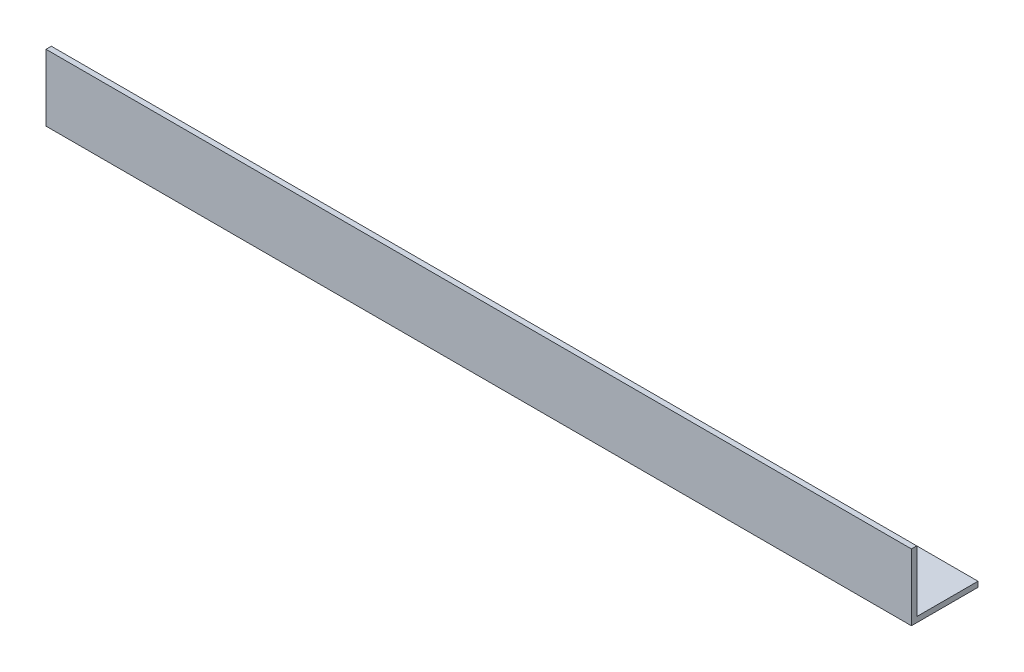
ISO-10303-21;
HEADER;
FILE_DESCRIPTION(('STEP AP214'),'2;1');
FILE_NAME('part.step','',(''),(''),'','','');
FILE_SCHEMA(('AUTOMOTIVE_DESIGN { 1 0 10303 214 1 1 1 1 }'));
ENDSEC;
DATA;
#1=APPLICATION_CONTEXT('core data for automotive mechanical design processes');
#2=APPLICATION_PROTOCOL_DEFINITION('international standard','automotive_design',2000,#1);
#3=PRODUCT_CONTEXT('',#1,'mechanical');
#4=PRODUCT('Part','Part','',(#3));
#5=PRODUCT_RELATED_PRODUCT_CATEGORY('part','',(#4));
#6=PRODUCT_DEFINITION_FORMATION('','',#4);
#7=PRODUCT_DEFINITION_CONTEXT('part definition',#1,'design');
#8=PRODUCT_DEFINITION('design','',#6,#7);
#9=PRODUCT_DEFINITION_SHAPE('','',#8);
#10=(LENGTH_UNIT() NAMED_UNIT(*) SI_UNIT(.MILLI.,.METRE.));
#11=(NAMED_UNIT(*) PLANE_ANGLE_UNIT() SI_UNIT($,.RADIAN.));
#12=(NAMED_UNIT(*) SI_UNIT($,.STERADIAN.) SOLID_ANGLE_UNIT());
#13=UNCERTAINTY_MEASURE_WITH_UNIT(LENGTH_MEASURE(1.E-05),#10,'distance_accuracy_value','');
#14=(GEOMETRIC_REPRESENTATION_CONTEXT(3) GLOBAL_UNCERTAINTY_ASSIGNED_CONTEXT((#13)) GLOBAL_UNIT_ASSIGNED_CONTEXT((#10,
#11,#12)) REPRESENTATION_CONTEXT('',''));
#15=CARTESIAN_POINT('',(0.,0.,0.));
#16=DIRECTION('',(0.,0.,1.));
#17=DIRECTION('',(1.,0.,0.));
#18=AXIS2_PLACEMENT_3D('',#15,#16,#17);
#19=CARTESIAN_POINT('',(650.,0.,0.));
#20=DIRECTION('',(0.,1.,0.));
#21=DIRECTION('',(0.,0.,1.));
#22=AXIS2_PLACEMENT_3D('',#19,#20,#21);
#23=PLANE('',#22);
#24=DIRECTION('',(0.,0.,-1.));
#25=VECTOR('',#24,1.);
#26=CARTESIAN_POINT('',(0.,0.,0.));
#27=LINE('',#26,#25);
#28=CARTESIAN_POINT('',(0.,0.,0.));
#29=VERTEX_POINT('',#28);
#30=CARTESIAN_POINT('',(0.,0.,-50.));
#31=VERTEX_POINT('',#30);
#32=EDGE_CURVE('E125',#29,#31,#27,.T.);
#33=ORIENTED_EDGE('',*,*,#32,.T.);
#34=DIRECTION('',(-1.,0.,0.));
#35=VECTOR('',#34,1.);
#36=CARTESIAN_POINT('',(650.,0.,-50.));
#37=LINE('',#36,#35);
#38=CARTESIAN_POINT('',(650.,0.,-50.));
#39=VERTEX_POINT('',#38);
#40=EDGE_CURVE('E11',#39,#31,#37,.T.);
#41=ORIENTED_EDGE('',*,*,#40,.F.);
#42=DIRECTION('',(0.,0.,-1.));
#43=VECTOR('',#42,1.);
#44=CARTESIAN_POINT('',(650.,0.,0.));
#45=LINE('',#44,#43);
#46=CARTESIAN_POINT('',(650.,0.,0.));
#47=VERTEX_POINT('',#46);
#48=EDGE_CURVE('E86',#47,#39,#45,.T.);
#49=ORIENTED_EDGE('',*,*,#48,.F.);
#50=DIRECTION('',(-1.,0.,0.));
#51=VECTOR('',#50,1.);
#52=CARTESIAN_POINT('',(650.,0.,0.));
#53=LINE('',#52,#51);
#54=EDGE_CURVE('E121',#47,#29,#53,.T.);
#55=ORIENTED_EDGE('',*,*,#54,.T.);
#56=EDGE_LOOP('',(#33,#41,#49,#55));
#57=FACE_BOUND('',#56,.T.);
#58=ADVANCED_FACE('F39',(#57),#23,.F.);
#59=CARTESIAN_POINT('',(650.,4.,-50.));
#60=DIRECTION('',(0.,0.,-1.));
#61=DIRECTION('',(-1.,0.,0.));
#62=AXIS2_PLACEMENT_3D('',#59,#60,#61);
#63=PLANE('',#62);
#64=DIRECTION('',(0.,-1.,0.));
#65=VECTOR('',#64,1.);
#66=CARTESIAN_POINT('',(0.,4.,-50.));
#67=LINE('',#66,#65);
#68=CARTESIAN_POINT('',(0.,4.,-50.));
#69=VERTEX_POINT('',#68);
#70=EDGE_CURVE('E129',#69,#31,#67,.T.);
#71=ORIENTED_EDGE('',*,*,#70,.F.);
#72=DIRECTION('',(-1.,0.,0.));
#73=VECTOR('',#72,1.);
#74=CARTESIAN_POINT('',(650.,4.,-50.));
#75=LINE('',#74,#73);
#76=CARTESIAN_POINT('',(650.,4.,-50.));
#77=VERTEX_POINT('',#76);
#78=EDGE_CURVE('E48',#77,#69,#75,.T.);
#79=ORIENTED_EDGE('',*,*,#78,.F.);
#80=DIRECTION('',(0.,-1.,0.));
#81=VECTOR('',#80,1.);
#82=CARTESIAN_POINT('',(650.,4.,-50.));
#83=LINE('',#82,#81);
#84=EDGE_CURVE('E225',#77,#39,#83,.T.);
#85=ORIENTED_EDGE('',*,*,#84,.T.);
#86=ORIENTED_EDGE('',*,*,#40,.T.);
#87=EDGE_LOOP('',(#71,#79,#85,#86));
#88=FACE_BOUND('',#87,.T.);
#89=ADVANCED_FACE('F156',(#88),#63,.T.);
#90=CARTESIAN_POINT('',(650.,4.,0.));
#91=DIRECTION('',(0.,1.,0.));
#92=DIRECTION('',(0.,0.,1.));
#93=AXIS2_PLACEMENT_3D('',#90,#91,#92);
#94=PLANE('',#93);
#95=DIRECTION('',(0.,0.,-1.));
#96=VECTOR('',#95,1.);
#97=CARTESIAN_POINT('',(0.,4.,0.));
#98=LINE('',#97,#96);
#99=CARTESIAN_POINT('',(0.,4.,-4.));
#100=VERTEX_POINT('',#99);
#101=EDGE_CURVE('E133',#100,#69,#98,.T.);
#102=ORIENTED_EDGE('',*,*,#101,.F.);
#103=DIRECTION('',(-1.,0.,0.));
#104=VECTOR('',#103,1.);
#105=CARTESIAN_POINT('',(650.,4.,-4.));
#106=LINE('',#105,#104);
#107=CARTESIAN_POINT('',(650.,4.,-4.));
#108=VERTEX_POINT('',#107);
#109=EDGE_CURVE('E108',#108,#100,#106,.T.);
#110=ORIENTED_EDGE('',*,*,#109,.F.);
#111=DIRECTION('',(0.,0.,-1.));
#112=VECTOR('',#111,1.);
#113=CARTESIAN_POINT('',(650.,4.,0.));
#114=LINE('',#113,#112);
#115=EDGE_CURVE('E114',#108,#77,#114,.T.);
#116=ORIENTED_EDGE('',*,*,#115,.T.);
#117=ORIENTED_EDGE('',*,*,#78,.T.);
#118=EDGE_LOOP('',(#102,#110,#116,#117));
#119=FACE_BOUND('',#118,.T.);
#120=ADVANCED_FACE('F153',(#119),#94,.T.);
#121=CARTESIAN_POINT('',(650.,50.,-4.));
#122=DIRECTION('',(0.,0.,-1.));
#123=DIRECTION('',(0.,1.,0.));
#124=AXIS2_PLACEMENT_3D('',#121,#122,#123);
#125=PLANE('',#124);
#126=DIRECTION('',(0.,-1.,0.));
#127=VECTOR('',#126,1.);
#128=CARTESIAN_POINT('',(0.,50.,-4.));
#129=LINE('',#128,#127);
#130=CARTESIAN_POINT('',(0.,50.,-4.));
#131=VERTEX_POINT('',#130);
#132=EDGE_CURVE('E102',#131,#100,#129,.T.);
#133=ORIENTED_EDGE('',*,*,#132,.F.);
#134=DIRECTION('',(-1.,0.,0.));
#135=VECTOR('',#134,1.);
#136=CARTESIAN_POINT('',(650.,50.,-4.));
#137=LINE('',#136,#135);
#138=CARTESIAN_POINT('',(650.,50.,-4.));
#139=VERTEX_POINT('',#138);
#140=EDGE_CURVE('E97',#139,#131,#137,.T.);
#141=ORIENTED_EDGE('',*,*,#140,.F.);
#142=DIRECTION('',(0.,-1.,0.));
#143=VECTOR('',#142,1.);
#144=CARTESIAN_POINT('',(650.,50.,-4.));
#145=LINE('',#144,#143);
#146=EDGE_CURVE('E100',#139,#108,#145,.T.);
#147=ORIENTED_EDGE('',*,*,#146,.T.);
#148=ORIENTED_EDGE('',*,*,#109,.T.);
#149=EDGE_LOOP('',(#133,#141,#147,#148));
#150=FACE_BOUND('',#149,.T.);
#151=ADVANCED_FACE('F99',(#150),#125,.T.);
#152=CARTESIAN_POINT('',(650.,50.,0.));
#153=DIRECTION('',(0.,1.,0.));
#154=DIRECTION('',(0.,0.,1.));
#155=AXIS2_PLACEMENT_3D('',#152,#153,#154);
#156=PLANE('',#155);
#157=DIRECTION('',(0.,0.,-1.));
#158=VECTOR('',#157,1.);
#159=CARTESIAN_POINT('',(0.,50.,0.));
#160=LINE('',#159,#158);
#161=CARTESIAN_POINT('',(0.,50.,0.));
#162=VERTEX_POINT('',#161);
#163=EDGE_CURVE('E139',#162,#131,#160,.T.);
#164=ORIENTED_EDGE('',*,*,#163,.F.);
#165=DIRECTION('',(-1.,0.,0.));
#166=VECTOR('',#165,1.);
#167=CARTESIAN_POINT('',(650.,50.,0.));
#168=LINE('',#167,#166);
#169=CARTESIAN_POINT('',(650.,50.,0.));
#170=VERTEX_POINT('',#169);
#171=EDGE_CURVE('E77',#170,#162,#168,.T.);
#172=ORIENTED_EDGE('',*,*,#171,.F.);
#173=DIRECTION('',(0.,0.,-1.));
#174=VECTOR('',#173,1.);
#175=CARTESIAN_POINT('',(650.,50.,0.));
#176=LINE('',#175,#174);
#177=EDGE_CURVE('E112',#170,#139,#176,.T.);
#178=ORIENTED_EDGE('',*,*,#177,.T.);
#179=ORIENTED_EDGE('',*,*,#140,.T.);
#180=EDGE_LOOP('',(#164,#172,#178,#179));
#181=FACE_BOUND('',#180,.T.);
#182=ADVANCED_FACE('F117',(#181),#156,.T.);
#183=CARTESIAN_POINT('',(650.,50.,0.));
#184=DIRECTION('',(0.,0.,-1.));
#185=DIRECTION('',(0.,1.,0.));
#186=AXIS2_PLACEMENT_3D('',#183,#184,#185);
#187=PLANE('',#186);
#188=DIRECTION('',(0.,-1.,0.));
#189=VECTOR('',#188,1.);
#190=CARTESIAN_POINT('',(0.,50.,0.));
#191=LINE('',#190,#189);
#192=EDGE_CURVE('E80',#162,#29,#191,.T.);
#193=ORIENTED_EDGE('',*,*,#192,.T.);
#194=ORIENTED_EDGE('',*,*,#54,.F.);
#195=DIRECTION('',(0.,-1.,0.));
#196=VECTOR('',#195,1.);
#197=CARTESIAN_POINT('',(650.,50.,0.));
#198=LINE('',#197,#196);
#199=EDGE_CURVE('E56',#170,#47,#198,.T.);
#200=ORIENTED_EDGE('',*,*,#199,.F.);
#201=ORIENTED_EDGE('',*,*,#171,.T.);
#202=EDGE_LOOP('',(#193,#194,#200,#201));
#203=FACE_BOUND('',#202,.T.);
#204=ADVANCED_FACE('F161',(#203),#187,.F.);
#205=CARTESIAN_POINT('',(650.,0.,0.));
#206=DIRECTION('',(-1.,0.,0.));
#207=DIRECTION('',(0.,0.,1.));
#208=AXIS2_PLACEMENT_3D('',#205,#206,#207);
#209=PLANE('',#208);
#210=ORIENTED_EDGE('',*,*,#48,.T.);
#211=ORIENTED_EDGE('',*,*,#84,.F.);
#212=ORIENTED_EDGE('',*,*,#115,.F.);
#213=ORIENTED_EDGE('',*,*,#146,.F.);
#214=ORIENTED_EDGE('',*,*,#177,.F.);
#215=ORIENTED_EDGE('',*,*,#199,.T.);
#216=EDGE_LOOP('',(#210,#211,#212,#213,#214,#215));
#217=FACE_BOUND('',#216,.T.);
#218=ADVANCED_FACE('F111',(#217),#209,.F.);
#219=CARTESIAN_POINT('',(0.,0.,0.));
#220=DIRECTION('',(-1.,0.,0.));
#221=DIRECTION('',(0.,0.,1.));
#222=AXIS2_PLACEMENT_3D('',#219,#220,#221);
#223=PLANE('',#222);
#224=ORIENTED_EDGE('',*,*,#32,.F.);
#225=ORIENTED_EDGE('',*,*,#192,.F.);
#226=ORIENTED_EDGE('',*,*,#163,.T.);
#227=ORIENTED_EDGE('',*,*,#132,.T.);
#228=ORIENTED_EDGE('',*,*,#101,.T.);
#229=ORIENTED_EDGE('',*,*,#70,.T.);
#230=EDGE_LOOP('',(#224,#225,#226,#227,#228,#229));
#231=FACE_BOUND('',#230,.T.);
#232=ADVANCED_FACE('F159',(#231),#223,.T.);
#233=CLOSED_SHELL('',(#58,#89,#120,#151,#182,#204,#218,#232));
#234=MANIFOLD_SOLID_BREP('B2',#233);
#235=ADVANCED_BREP_SHAPE_REPRESENTATION('',(#18,#234),#14);
#236=SHAPE_DEFINITION_REPRESENTATION(#9,#235);
ENDSEC;
END-ISO-10303-21;
